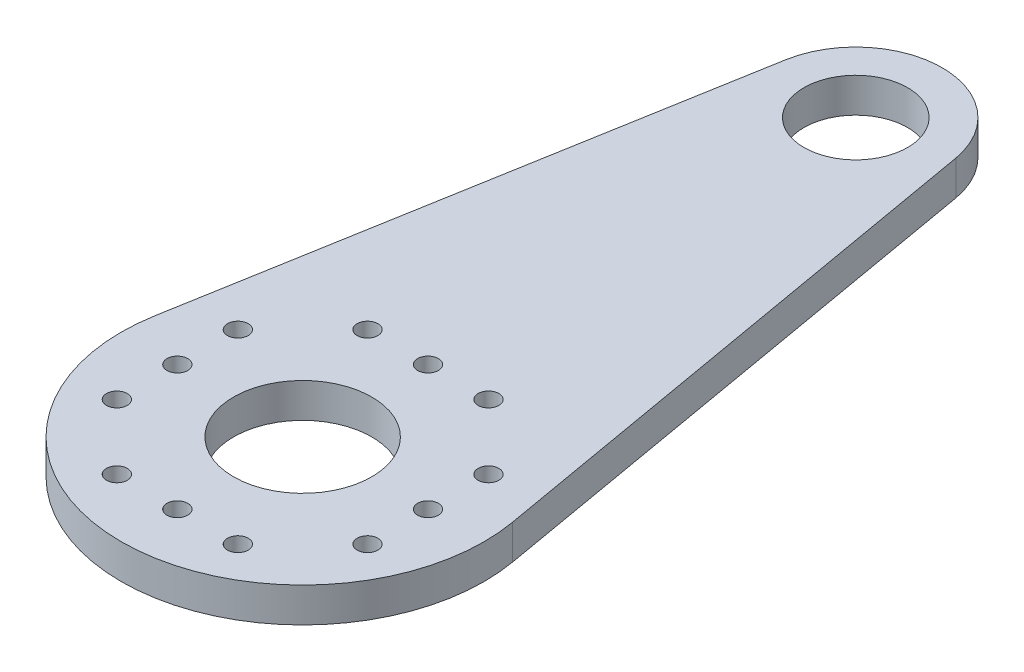
ISO-10303-21;
HEADER;
FILE_DESCRIPTION(('STEP AP214'),'2;1');
FILE_NAME('part.step','',(''),(''),'','','');
FILE_SCHEMA(('AUTOMOTIVE_DESIGN { 1 0 10303 214 1 1 1 1 }'));
ENDSEC;
DATA;
#1=APPLICATION_CONTEXT('core data for automotive mechanical design processes');
#2=APPLICATION_PROTOCOL_DEFINITION('international standard','automotive_design',2000,#1);
#3=PRODUCT_CONTEXT('',#1,'mechanical');
#4=PRODUCT('Part','Part','',(#3));
#5=PRODUCT_RELATED_PRODUCT_CATEGORY('part','',(#4));
#6=PRODUCT_DEFINITION_FORMATION('','',#4);
#7=PRODUCT_DEFINITION_CONTEXT('part definition',#1,'design');
#8=PRODUCT_DEFINITION('design','',#6,#7);
#9=PRODUCT_DEFINITION_SHAPE('','',#8);
#10=(LENGTH_UNIT() NAMED_UNIT(*) SI_UNIT(.MILLI.,.METRE.));
#11=(NAMED_UNIT(*) PLANE_ANGLE_UNIT() SI_UNIT($,.RADIAN.));
#12=(NAMED_UNIT(*) SI_UNIT($,.STERADIAN.) SOLID_ANGLE_UNIT());
#13=UNCERTAINTY_MEASURE_WITH_UNIT(LENGTH_MEASURE(1.E-05),#10,'distance_accuracy_value','');
#14=(GEOMETRIC_REPRESENTATION_CONTEXT(3) GLOBAL_UNCERTAINTY_ASSIGNED_CONTEXT((#13)) GLOBAL_UNIT_ASSIGNED_CONTEXT((#10,
#11,#12)) REPRESENTATION_CONTEXT('',''));
#15=CARTESIAN_POINT('',(0.,0.,0.));
#16=DIRECTION('',(0.,0.,1.));
#17=DIRECTION('',(1.,0.,0.));
#18=AXIS2_PLACEMENT_3D('',#15,#16,#17);
#19=CARTESIAN_POINT('',(0.,2.,-32.));
#20=DIRECTION('',(0.,1.,0.));
#21=DIRECTION('',(0.,0.,1.));
#22=AXIS2_PLACEMENT_3D('',#19,#20,#21);
#23=PLANE('',#22);
#24=CARTESIAN_POINT('',(-7.24999999999999,2.,3.50000000000003));
#25=DIRECTION('',(0.,1.,0.));
#26=DIRECTION('',(1.,0.,0.));
#27=AXIS2_PLACEMENT_3D('',#24,#25,#26);
#28=CIRCLE('',#27,0.6);
#29=CARTESIAN_POINT('',(-6.64999999999999,2.,3.50000000000002));
#30=VERTEX_POINT('',#29);
#31=EDGE_CURVE('E171',#30,#30,#28,.T.);
#32=ORIENTED_EDGE('',*,*,#31,.F.);
#33=EDGE_LOOP('',(#32));
#34=FACE_BOUND('',#33,.T.);
#35=CARTESIAN_POINT('',(3.5,2.,7.25));
#36=DIRECTION('',(0.,1.,0.));
#37=DIRECTION('',(0.,0.,-1.));
#38=AXIS2_PLACEMENT_3D('',#35,#36,#37);
#39=CIRCLE('',#38,0.6);
#40=CARTESIAN_POINT('',(3.5,2.,6.65));
#41=VERTEX_POINT('',#40);
#42=EDGE_CURVE('E189',#41,#41,#39,.T.);
#43=ORIENTED_EDGE('',*,*,#42,.F.);
#44=EDGE_LOOP('',(#43));
#45=FACE_BOUND('',#44,.T.);
#46=CARTESIAN_POINT('',(7.24999999999996,2.,-3.50000000000008));
#47=DIRECTION('',(0.,1.,0.));
#48=DIRECTION('',(-1.,0.,0.));
#49=AXIS2_PLACEMENT_3D('',#46,#47,#48);
#50=CIRCLE('',#49,0.6);
#51=CARTESIAN_POINT('',(6.64999999999996,2.,-3.50000000000007));
#52=VERTEX_POINT('',#51);
#53=EDGE_CURVE('E182',#52,#52,#50,.T.);
#54=ORIENTED_EDGE('',*,*,#53,.F.);
#55=EDGE_LOOP('',(#54));
#56=FACE_BOUND('',#55,.T.);
#57=CARTESIAN_POINT('',(-7.25,2.,0.));
#58=DIRECTION('',(0.,1.,0.));
#59=DIRECTION('',(1.,0.,0.));
#60=AXIS2_PLACEMENT_3D('',#57,#58,#59);
#61=CIRCLE('',#60,0.6);
#62=CARTESIAN_POINT('',(-6.65,2.,0.));
#63=VERTEX_POINT('',#62);
#64=EDGE_CURVE('E153',#63,#63,#61,.T.);
#65=ORIENTED_EDGE('',*,*,#64,.F.);
#66=EDGE_LOOP('',(#65));
#67=FACE_BOUND('',#66,.T.);
#68=CARTESIAN_POINT('',(0.,2.,7.25));
#69=DIRECTION('',(0.,1.,0.));
#70=DIRECTION('',(0.,0.,-1.));
#71=AXIS2_PLACEMENT_3D('',#68,#69,#70);
#72=CIRCLE('',#71,0.6);
#73=CARTESIAN_POINT('',(0.,2.,6.65));
#74=VERTEX_POINT('',#73);
#75=EDGE_CURVE('E172',#74,#74,#72,.T.);
#76=ORIENTED_EDGE('',*,*,#75,.F.);
#77=EDGE_LOOP('',(#76));
#78=FACE_BOUND('',#77,.T.);
#79=CARTESIAN_POINT('',(7.25,2.,0.));
#80=DIRECTION('',(0.,1.,0.));
#81=DIRECTION('',(-1.,0.,0.));
#82=AXIS2_PLACEMENT_3D('',#79,#80,#81);
#83=CIRCLE('',#82,0.6);
#84=CARTESIAN_POINT('',(6.65,2.,0.));
#85=VERTEX_POINT('',#84);
#86=EDGE_CURVE('E164',#85,#85,#83,.T.);
#87=ORIENTED_EDGE('',*,*,#86,.F.);
#88=EDGE_LOOP('',(#87));
#89=FACE_BOUND('',#88,.T.);
#90=CARTESIAN_POINT('',(-7.25000000000001,2.,-3.49999999999998));
#91=DIRECTION('',(0.,1.,0.));
#92=DIRECTION('',(1.,0.,0.));
#93=AXIS2_PLACEMENT_3D('',#90,#91,#92);
#94=CIRCLE('',#93,0.6);
#95=CARTESIAN_POINT('',(-6.65000000000001,2.,-3.49999999999998));
#96=VERTEX_POINT('',#95);
#97=EDGE_CURVE('E141',#96,#96,#94,.T.);
#98=ORIENTED_EDGE('',*,*,#97,.F.);
#99=EDGE_LOOP('',(#98));
#100=FACE_BOUND('',#99,.T.);
#101=CARTESIAN_POINT('',(-3.5,2.,7.25));
#102=DIRECTION('',(0.,1.,0.));
#103=DIRECTION('',(0.,0.,-1.));
#104=AXIS2_PLACEMENT_3D('',#101,#102,#103);
#105=CIRCLE('',#104,0.6);
#106=CARTESIAN_POINT('',(-3.5,2.,6.65));
#107=VERTEX_POINT('',#106);
#108=EDGE_CURVE('E154',#107,#107,#105,.T.);
#109=ORIENTED_EDGE('',*,*,#108,.F.);
#110=EDGE_LOOP('',(#109));
#111=FACE_BOUND('',#110,.T.);
#112=CARTESIAN_POINT('',(7.25000000000004,2.,3.49999999999992));
#113=DIRECTION('',(0.,1.,0.));
#114=DIRECTION('',(-1.,0.,0.));
#115=AXIS2_PLACEMENT_3D('',#112,#113,#114);
#116=CIRCLE('',#115,0.6);
#117=CARTESIAN_POINT('',(6.65000000000004,2.,3.49999999999993));
#118=VERTEX_POINT('',#117);
#119=EDGE_CURVE('E146',#118,#118,#116,.T.);
#120=ORIENTED_EDGE('',*,*,#119,.F.);
#121=EDGE_LOOP('',(#120));
#122=FACE_BOUND('',#121,.T.);
#123=CARTESIAN_POINT('',(3.5,2.,-7.25));
#124=DIRECTION('',(0.,1.,0.));
#125=DIRECTION('',(0.,0.,1.));
#126=AXIS2_PLACEMENT_3D('',#123,#124,#125);
#127=CIRCLE('',#126,0.6);
#128=CARTESIAN_POINT('',(3.5,2.,-6.65));
#129=VERTEX_POINT('',#128);
#130=EDGE_CURVE('E138',#129,#129,#127,.T.);
#131=ORIENTED_EDGE('',*,*,#130,.F.);
#132=EDGE_LOOP('',(#131));
#133=FACE_BOUND('',#132,.T.);
#134=CARTESIAN_POINT('',(-3.5,2.,-7.25));
#135=DIRECTION('',(0.,1.,0.));
#136=DIRECTION('',(0.,0.,1.));
#137=AXIS2_PLACEMENT_3D('',#134,#135,#136);
#138=CIRCLE('',#137,0.6);
#139=CARTESIAN_POINT('',(-3.5,2.,-6.65));
#140=VERTEX_POINT('',#139);
#141=EDGE_CURVE('E137',#140,#140,#138,.T.);
#142=ORIENTED_EDGE('',*,*,#141,.F.);
#143=EDGE_LOOP('',(#142));
#144=FACE_BOUND('',#143,.T.);
#145=CARTESIAN_POINT('',(0.,2.,-7.25));
#146=DIRECTION('',(0.,1.,0.));
#147=DIRECTION('',(0.,0.,1.));
#148=AXIS2_PLACEMENT_3D('',#145,#146,#147);
#149=CIRCLE('',#148,0.6);
#150=CARTESIAN_POINT('',(0.,2.,-6.65));
#151=VERTEX_POINT('',#150);
#152=EDGE_CURVE('E130',#151,#151,#149,.T.);
#153=ORIENTED_EDGE('',*,*,#152,.F.);
#154=EDGE_LOOP('',(#153));
#155=FACE_BOUND('',#154,.T.);
#156=CARTESIAN_POINT('',(0.,2.,0.));
#157=DIRECTION('',(0.,1.,0.));
#158=DIRECTION('',(0.,0.,1.));
#159=AXIS2_PLACEMENT_3D('',#156,#157,#158);
#160=CIRCLE('',#159,4.);
#161=CARTESIAN_POINT('',(0.,2.,4.));
#162=VERTEX_POINT('',#161);
#163=EDGE_CURVE('E104',#162,#162,#160,.T.);
#164=ORIENTED_EDGE('',*,*,#163,.F.);
#165=EDGE_LOOP('',(#164));
#166=FACE_BOUND('',#165,.T.);
#167=CARTESIAN_POINT('',(0.,2.,-32.));
#168=DIRECTION('',(0.,1.,0.));
#169=DIRECTION('',(0.,0.,1.));
#170=AXIS2_PLACEMENT_3D('',#167,#168,#169);
#171=CIRCLE('',#170,5.);
#172=CARTESIAN_POINT('',(4.92559383317129,2.,-32.859375));
#173=VERTEX_POINT('',#172);
#174=CARTESIAN_POINT('',(-4.92559383317129,2.,-32.859375));
#175=VERTEX_POINT('',#174);
#176=EDGE_CURVE('E89',#173,#175,#171,.T.);
#177=ORIENTED_EDGE('',*,*,#176,.T.);
#178=DIRECTION('',(-0.171875,0.,0.985118766634257));
#179=VECTOR('',#178,1.);
#180=CARTESIAN_POINT('',(-4.92559383317129,2.,-32.859375));
#181=LINE('',#180,#179);
#182=CARTESIAN_POINT('',(-10.3437470496597,2.,-1.80468750000001));
#183=VERTEX_POINT('',#182);
#184=EDGE_CURVE('E84',#175,#183,#181,.T.);
#185=ORIENTED_EDGE('',*,*,#184,.T.);
#186=CARTESIAN_POINT('',(0.,2.,0.));
#187=DIRECTION('',(0.,1.,0.));
#188=DIRECTION('',(0.,0.,1.));
#189=AXIS2_PLACEMENT_3D('',#186,#187,#188);
#190=CIRCLE('',#189,10.5);
#191=CARTESIAN_POINT('',(10.3437470496597,2.,-1.8046875));
#192=VERTEX_POINT('',#191);
#193=EDGE_CURVE('E87',#183,#192,#190,.T.);
#194=ORIENTED_EDGE('',*,*,#193,.T.);
#195=DIRECTION('',(-0.171875,0.,-0.985118766634257));
#196=VECTOR('',#195,1.);
#197=CARTESIAN_POINT('',(4.92559383317129,2.,-32.859375));
#198=LINE('',#197,#196);
#199=EDGE_CURVE('E54',#192,#173,#198,.T.);
#200=ORIENTED_EDGE('',*,*,#199,.T.);
#201=EDGE_LOOP('',(#177,#185,#194,#200));
#202=FACE_BOUND('',#201,.T.);
#203=CARTESIAN_POINT('',(0.,2.,-32.));
#204=DIRECTION('',(0.,1.,0.));
#205=DIRECTION('',(0.,0.,1.));
#206=AXIS2_PLACEMENT_3D('',#203,#204,#205);
#207=CIRCLE('',#206,3.);
#208=CARTESIAN_POINT('',(0.,2.,-29.));
#209=VERTEX_POINT('',#208);
#210=EDGE_CURVE('E119',#209,#209,#207,.T.);
#211=ORIENTED_EDGE('',*,*,#210,.F.);
#212=EDGE_LOOP('',(#211));
#213=FACE_BOUND('',#212,.T.);
#214=ADVANCED_FACE('F37',(#34,#45,#56,#67,#78,#89,#100,#111,#122,#133,#144,#155,#166,#202,#213),
#23,.T.);
#215=CARTESIAN_POINT('',(0.,0.,-32.));
#216=DIRECTION('',(0.,1.,0.));
#217=DIRECTION('',(0.,0.,1.));
#218=AXIS2_PLACEMENT_3D('',#215,#216,#217);
#219=PLANE('',#218);
#220=CARTESIAN_POINT('',(-7.24999999999999,0.,3.50000000000003));
#221=DIRECTION('',(0.,1.,0.));
#222=DIRECTION('',(1.,0.,0.));
#223=AXIS2_PLACEMENT_3D('',#220,#221,#222);
#224=CIRCLE('',#223,0.6);
#225=CARTESIAN_POINT('',(-6.64999999999999,0.,3.50000000000002));
#226=VERTEX_POINT('',#225);
#227=EDGE_CURVE('E192',#226,#226,#224,.F.);
#228=ORIENTED_EDGE('',*,*,#227,.F.);
#229=EDGE_LOOP('',(#228));
#230=FACE_BOUND('',#229,.T.);
#231=CARTESIAN_POINT('',(3.5,0.,7.25));
#232=DIRECTION('',(0.,1.,0.));
#233=DIRECTION('',(0.,0.,-1.));
#234=AXIS2_PLACEMENT_3D('',#231,#232,#233);
#235=CIRCLE('',#234,0.6);
#236=CARTESIAN_POINT('',(3.5,0.,6.65));
#237=VERTEX_POINT('',#236);
#238=EDGE_CURVE('E185',#237,#237,#235,.F.);
#239=ORIENTED_EDGE('',*,*,#238,.F.);
#240=EDGE_LOOP('',(#239));
#241=FACE_BOUND('',#240,.T.);
#242=CARTESIAN_POINT('',(7.24999999999996,0.,-3.50000000000008));
#243=DIRECTION('',(0.,1.,0.));
#244=DIRECTION('',(-1.,0.,0.));
#245=AXIS2_PLACEMENT_3D('',#242,#243,#244);
#246=CIRCLE('',#245,0.6);
#247=CARTESIAN_POINT('',(6.64999999999996,0.,-3.50000000000007));
#248=VERTEX_POINT('',#247);
#249=EDGE_CURVE('E186',#248,#248,#246,.F.);
#250=ORIENTED_EDGE('',*,*,#249,.F.);
#251=EDGE_LOOP('',(#250));
#252=FACE_BOUND('',#251,.T.);
#253=CARTESIAN_POINT('',(-7.25,0.,0.));
#254=DIRECTION('',(0.,1.,0.));
#255=DIRECTION('',(1.,0.,0.));
#256=AXIS2_PLACEMENT_3D('',#253,#254,#255);
#257=CIRCLE('',#256,0.6);
#258=CARTESIAN_POINT('',(-6.65,0.,0.));
#259=VERTEX_POINT('',#258);
#260=EDGE_CURVE('E175',#259,#259,#257,.F.);
#261=ORIENTED_EDGE('',*,*,#260,.F.);
#262=EDGE_LOOP('',(#261));
#263=FACE_BOUND('',#262,.T.);
#264=CARTESIAN_POINT('',(0.,0.,7.25));
#265=DIRECTION('',(0.,1.,0.));
#266=DIRECTION('',(0.,0.,-1.));
#267=AXIS2_PLACEMENT_3D('',#264,#265,#266);
#268=CIRCLE('',#267,0.6);
#269=CARTESIAN_POINT('',(0.,0.,6.65));
#270=VERTEX_POINT('',#269);
#271=EDGE_CURVE('E167',#270,#270,#268,.F.);
#272=ORIENTED_EDGE('',*,*,#271,.F.);
#273=EDGE_LOOP('',(#272));
#274=FACE_BOUND('',#273,.T.);
#275=CARTESIAN_POINT('',(7.25,0.,0.));
#276=DIRECTION('',(0.,1.,0.));
#277=DIRECTION('',(-1.,0.,0.));
#278=AXIS2_PLACEMENT_3D('',#275,#276,#277);
#279=CIRCLE('',#278,0.6);
#280=CARTESIAN_POINT('',(6.65,0.,0.));
#281=VERTEX_POINT('',#280);
#282=EDGE_CURVE('E168',#281,#281,#279,.F.);
#283=ORIENTED_EDGE('',*,*,#282,.F.);
#284=EDGE_LOOP('',(#283));
#285=FACE_BOUND('',#284,.T.);
#286=CARTESIAN_POINT('',(-7.25000000000001,0.,-3.49999999999998));
#287=DIRECTION('',(0.,1.,0.));
#288=DIRECTION('',(1.,0.,0.));
#289=AXIS2_PLACEMENT_3D('',#286,#287,#288);
#290=CIRCLE('',#289,0.6);
#291=CARTESIAN_POINT('',(-6.65000000000001,0.,-3.49999999999998));
#292=VERTEX_POINT('',#291);
#293=EDGE_CURVE('E157',#292,#292,#290,.F.);
#294=ORIENTED_EDGE('',*,*,#293,.F.);
#295=EDGE_LOOP('',(#294));
#296=FACE_BOUND('',#295,.T.);
#297=CARTESIAN_POINT('',(-3.5,0.,7.25));
#298=DIRECTION('',(0.,1.,0.));
#299=DIRECTION('',(0.,0.,-1.));
#300=AXIS2_PLACEMENT_3D('',#297,#298,#299);
#301=CIRCLE('',#300,0.6);
#302=CARTESIAN_POINT('',(-3.5,0.,6.65));
#303=VERTEX_POINT('',#302);
#304=EDGE_CURVE('E149',#303,#303,#301,.F.);
#305=ORIENTED_EDGE('',*,*,#304,.F.);
#306=EDGE_LOOP('',(#305));
#307=FACE_BOUND('',#306,.T.);
#308=CARTESIAN_POINT('',(7.25000000000004,0.,3.49999999999992));
#309=DIRECTION('',(0.,1.,0.));
#310=DIRECTION('',(-1.,0.,0.));
#311=AXIS2_PLACEMENT_3D('',#308,#309,#310);
#312=CIRCLE('',#311,0.6);
#313=CARTESIAN_POINT('',(6.65000000000004,0.,3.49999999999993));
#314=VERTEX_POINT('',#313);
#315=EDGE_CURVE('E150',#314,#314,#312,.F.);
#316=ORIENTED_EDGE('',*,*,#315,.F.);
#317=EDGE_LOOP('',(#316));
#318=FACE_BOUND('',#317,.T.);
#319=CARTESIAN_POINT('',(3.5,0.,-7.25));
#320=DIRECTION('',(0.,1.,0.));
#321=DIRECTION('',(0.,0.,1.));
#322=AXIS2_PLACEMENT_3D('',#319,#320,#321);
#323=CIRCLE('',#322,0.6);
#324=CARTESIAN_POINT('',(3.5,0.,-6.65));
#325=VERTEX_POINT('',#324);
#326=EDGE_CURVE('E134',#325,#325,#323,.F.);
#327=ORIENTED_EDGE('',*,*,#326,.F.);
#328=EDGE_LOOP('',(#327));
#329=FACE_BOUND('',#328,.T.);
#330=CARTESIAN_POINT('',(-3.5,0.,-7.25));
#331=DIRECTION('',(0.,1.,0.));
#332=DIRECTION('',(0.,0.,1.));
#333=AXIS2_PLACEMENT_3D('',#330,#331,#332);
#334=CIRCLE('',#333,0.6);
#335=CARTESIAN_POINT('',(-3.5,0.,-6.65));
#336=VERTEX_POINT('',#335);
#337=EDGE_CURVE('E133',#336,#336,#334,.F.);
#338=ORIENTED_EDGE('',*,*,#337,.F.);
#339=EDGE_LOOP('',(#338));
#340=FACE_BOUND('',#339,.T.);
#341=CARTESIAN_POINT('',(0.,0.,-7.25));
#342=DIRECTION('',(0.,1.,0.));
#343=DIRECTION('',(0.,0.,1.));
#344=AXIS2_PLACEMENT_3D('',#341,#342,#343);
#345=CIRCLE('',#344,0.6);
#346=CARTESIAN_POINT('',(0.,0.,-6.65));
#347=VERTEX_POINT('',#346);
#348=EDGE_CURVE('E125',#347,#347,#345,.F.);
#349=ORIENTED_EDGE('',*,*,#348,.F.);
#350=EDGE_LOOP('',(#349));
#351=FACE_BOUND('',#350,.T.);
#352=CARTESIAN_POINT('',(0.,0.,-32.));
#353=DIRECTION('',(0.,1.,0.));
#354=DIRECTION('',(0.,0.,1.));
#355=AXIS2_PLACEMENT_3D('',#352,#353,#354);
#356=CIRCLE('',#355,5.);
#357=CARTESIAN_POINT('',(4.92559383317129,0.,-32.859375));
#358=VERTEX_POINT('',#357);
#359=CARTESIAN_POINT('',(-4.92559383317129,0.,-32.859375));
#360=VERTEX_POINT('',#359);
#361=EDGE_CURVE('E101',#358,#360,#356,.T.);
#362=ORIENTED_EDGE('',*,*,#361,.F.);
#363=DIRECTION('',(-0.171875,0.,-0.985118766634257));
#364=VECTOR('',#363,1.);
#365=CARTESIAN_POINT('',(4.92559383317129,0.,-32.859375));
#366=LINE('',#365,#364);
#367=CARTESIAN_POINT('',(10.3437470496597,0.,-1.8046875));
#368=VERTEX_POINT('',#367);
#369=EDGE_CURVE('E77',#368,#358,#366,.T.);
#370=ORIENTED_EDGE('',*,*,#369,.F.);
#371=CARTESIAN_POINT('',(0.,0.,0.));
#372=DIRECTION('',(0.,1.,0.));
#373=DIRECTION('',(0.,0.,1.));
#374=AXIS2_PLACEMENT_3D('',#371,#372,#373);
#375=CIRCLE('',#374,10.5);
#376=CARTESIAN_POINT('',(-10.3437470496597,0.,-1.80468750000001));
#377=VERTEX_POINT('',#376);
#378=EDGE_CURVE('E71',#377,#368,#375,.T.);
#379=ORIENTED_EDGE('',*,*,#378,.F.);
#380=DIRECTION('',(-0.171875,0.,0.985118766634257));
#381=VECTOR('',#380,1.);
#382=CARTESIAN_POINT('',(-4.92559383317129,0.,-32.859375));
#383=LINE('',#382,#381);
#384=EDGE_CURVE('E93',#360,#377,#383,.T.);
#385=ORIENTED_EDGE('',*,*,#384,.F.);
#386=EDGE_LOOP('',(#362,#370,#379,#385));
#387=FACE_BOUND('',#386,.T.);
#388=CARTESIAN_POINT('',(0.,0.,0.));
#389=DIRECTION('',(0.,1.,0.));
#390=DIRECTION('',(0.,0.,1.));
#391=AXIS2_PLACEMENT_3D('',#388,#389,#390);
#392=CIRCLE('',#391,4.);
#393=CARTESIAN_POINT('',(0.,0.,4.));
#394=VERTEX_POINT('',#393);
#395=EDGE_CURVE('E116',#394,#394,#392,.T.);
#396=ORIENTED_EDGE('',*,*,#395,.T.);
#397=EDGE_LOOP('',(#396));
#398=FACE_BOUND('',#397,.T.);
#399=CARTESIAN_POINT('',(0.,0.,-32.));
#400=DIRECTION('',(0.,1.,0.));
#401=DIRECTION('',(0.,0.,1.));
#402=AXIS2_PLACEMENT_3D('',#399,#400,#401);
#403=CIRCLE('',#402,3.);
#404=CARTESIAN_POINT('',(0.,0.,-29.));
#405=VERTEX_POINT('',#404);
#406=EDGE_CURVE('E122',#405,#405,#403,.T.);
#407=ORIENTED_EDGE('',*,*,#406,.T.);
#408=EDGE_LOOP('',(#407));
#409=FACE_BOUND('',#408,.T.);
#410=ADVANCED_FACE('F112',(#230,#241,#252,#263,#274,#285,#296,#307,#318,#329,#340,#351,#387,
#398,#409),#219,.F.);
#411=CARTESIAN_POINT('',(0.,2.,-32.));
#412=DIRECTION('',(0.,-1.,0.));
#413=DIRECTION('',(0.,0.,-1.));
#414=AXIS2_PLACEMENT_3D('',#411,#412,#413);
#415=CYLINDRICAL_SURFACE('',#414,5.);
#416=ORIENTED_EDGE('',*,*,#361,.T.);
#417=DIRECTION('',(0.,-1.,0.));
#418=VECTOR('',#417,1.);
#419=CARTESIAN_POINT('',(-4.92559383317129,2.,-32.859375));
#420=LINE('',#419,#418);
#421=EDGE_CURVE('E11',#175,#360,#420,.T.);
#422=ORIENTED_EDGE('',*,*,#421,.F.);
#423=ORIENTED_EDGE('',*,*,#176,.F.);
#424=DIRECTION('',(0.,-1.,0.));
#425=VECTOR('',#424,1.);
#426=CARTESIAN_POINT('',(4.92559383317129,2.,-32.859375));
#427=LINE('',#426,#425);
#428=EDGE_CURVE('E97',#173,#358,#427,.T.);
#429=ORIENTED_EDGE('',*,*,#428,.T.);
#430=EDGE_LOOP('',(#416,#422,#423,#429));
#431=FACE_BOUND('',#430,.T.);
#432=ADVANCED_FACE('F39',(#431),#415,.T.);
#433=CARTESIAN_POINT('',(-4.92559383317129,2.,-32.859375));
#434=DIRECTION('',(0.985118766634257,0.,0.171875));
#435=DIRECTION('',(0.171875,0.,-0.985118766634257));
#436=AXIS2_PLACEMENT_3D('',#433,#434,#435);
#437=PLANE('',#436);
#438=ORIENTED_EDGE('',*,*,#384,.T.);
#439=DIRECTION('',(0.,-1.,0.));
#440=VECTOR('',#439,1.);
#441=CARTESIAN_POINT('',(-10.3437470496597,2.,-1.80468750000001));
#442=LINE('',#441,#440);
#443=EDGE_CURVE('E46',#183,#377,#442,.T.);
#444=ORIENTED_EDGE('',*,*,#443,.F.);
#445=ORIENTED_EDGE('',*,*,#184,.F.);
#446=ORIENTED_EDGE('',*,*,#421,.T.);
#447=EDGE_LOOP('',(#438,#444,#445,#446));
#448=FACE_BOUND('',#447,.T.);
#449=ADVANCED_FACE('F92',(#448),#437,.F.);
#450=CARTESIAN_POINT('',(0.,2.,0.));
#451=DIRECTION('',(0.,-1.,0.));
#452=DIRECTION('',(0.,0.,-1.));
#453=AXIS2_PLACEMENT_3D('',#450,#451,#452);
#454=CYLINDRICAL_SURFACE('',#453,10.5);
#455=ORIENTED_EDGE('',*,*,#378,.T.);
#456=DIRECTION('',(0.,-1.,0.));
#457=VECTOR('',#456,1.);
#458=CARTESIAN_POINT('',(10.3437470496597,2.,-1.8046875));
#459=LINE('',#458,#457);
#460=EDGE_CURVE('E94',#192,#368,#459,.T.);
#461=ORIENTED_EDGE('',*,*,#460,.F.);
#462=ORIENTED_EDGE('',*,*,#193,.F.);
#463=ORIENTED_EDGE('',*,*,#443,.T.);
#464=EDGE_LOOP('',(#455,#461,#462,#463));
#465=FACE_BOUND('',#464,.T.);
#466=ADVANCED_FACE('F95',(#465),#454,.T.);
#467=CARTESIAN_POINT('',(4.92559383317129,2.,-32.859375));
#468=DIRECTION('',(-0.985118766634257,0.,0.171875));
#469=DIRECTION('',(0.171875,0.,0.985118766634257));
#470=AXIS2_PLACEMENT_3D('',#467,#468,#469);
#471=PLANE('',#470);
#472=ORIENTED_EDGE('',*,*,#369,.T.);
#473=ORIENTED_EDGE('',*,*,#428,.F.);
#474=ORIENTED_EDGE('',*,*,#199,.F.);
#475=ORIENTED_EDGE('',*,*,#460,.T.);
#476=EDGE_LOOP('',(#472,#473,#474,#475));
#477=FACE_BOUND('',#476,.T.);
#478=ADVANCED_FACE('F109',(#477),#471,.F.);
#479=CARTESIAN_POINT('',(0.,2.,0.));
#480=DIRECTION('',(0.,-1.,0.));
#481=DIRECTION('',(0.,0.,-1.));
#482=AXIS2_PLACEMENT_3D('',#479,#480,#481);
#483=CYLINDRICAL_SURFACE('',#482,4.);
#484=ORIENTED_EDGE('',*,*,#163,.T.);
#485=EDGE_LOOP('',(#484));
#486=FACE_BOUND('',#485,.T.);
#487=ORIENTED_EDGE('',*,*,#395,.F.);
#488=EDGE_LOOP('',(#487));
#489=FACE_BOUND('',#488,.T.);
#490=ADVANCED_FACE('F242',(#486,#489),#483,.F.);
#491=CARTESIAN_POINT('',(0.,2.,-32.));
#492=DIRECTION('',(0.,-1.,0.));
#493=DIRECTION('',(0.,0.,-1.));
#494=AXIS2_PLACEMENT_3D('',#491,#492,#493);
#495=CYLINDRICAL_SURFACE('',#494,3.);
#496=ORIENTED_EDGE('',*,*,#210,.T.);
#497=EDGE_LOOP('',(#496));
#498=FACE_BOUND('',#497,.T.);
#499=ORIENTED_EDGE('',*,*,#406,.F.);
#500=EDGE_LOOP('',(#499));
#501=FACE_BOUND('',#500,.T.);
#502=ADVANCED_FACE('F232',(#498,#501),#495,.F.);
#503=CARTESIAN_POINT('',(0.,-1.69705627484771,-7.25));
#504=DIRECTION('',(0.,1.,0.));
#505=DIRECTION('',(0.,0.,1.));
#506=AXIS2_PLACEMENT_3D('',#503,#504,#505);
#507=CYLINDRICAL_SURFACE('',#506,0.6);
#508=ORIENTED_EDGE('',*,*,#348,.T.);
#509=EDGE_LOOP('',(#508));
#510=FACE_BOUND('',#509,.T.);
#511=ORIENTED_EDGE('',*,*,#152,.T.);
#512=EDGE_LOOP('',(#511));
#513=FACE_BOUND('',#512,.T.);
#514=ADVANCED_FACE('F228',(#510,#513),#507,.F.);
#515=CARTESIAN_POINT('',(-3.5,-1.69705627484771,-7.25));
#516=DIRECTION('',(0.,1.,0.));
#517=DIRECTION('',(0.,0.,1.));
#518=AXIS2_PLACEMENT_3D('',#515,#516,#517);
#519=CYLINDRICAL_SURFACE('',#518,0.6);
#520=ORIENTED_EDGE('',*,*,#337,.T.);
#521=EDGE_LOOP('',(#520));
#522=FACE_BOUND('',#521,.T.);
#523=ORIENTED_EDGE('',*,*,#141,.T.);
#524=EDGE_LOOP('',(#523));
#525=FACE_BOUND('',#524,.T.);
#526=ADVANCED_FACE('F231',(#522,#525),#519,.F.);
#527=CARTESIAN_POINT('',(3.5,-1.69705627484771,-7.25));
#528=DIRECTION('',(0.,1.,0.));
#529=DIRECTION('',(0.,0.,1.));
#530=AXIS2_PLACEMENT_3D('',#527,#528,#529);
#531=CYLINDRICAL_SURFACE('',#530,0.6);
#532=ORIENTED_EDGE('',*,*,#326,.T.);
#533=EDGE_LOOP('',(#532));
#534=FACE_BOUND('',#533,.T.);
#535=ORIENTED_EDGE('',*,*,#130,.T.);
#536=EDGE_LOOP('',(#535));
#537=FACE_BOUND('',#536,.T.);
#538=ADVANCED_FACE('F280',(#534,#537),#531,.F.);
#539=CARTESIAN_POINT('',(7.25000000000004,-1.69705627484771,3.49999999999992));
#540=DIRECTION('',(0.,1.,0.));
#541=DIRECTION('',(-1.,0.,0.));
#542=AXIS2_PLACEMENT_3D('',#539,#540,#541);
#543=CYLINDRICAL_SURFACE('',#542,0.6);
#544=ORIENTED_EDGE('',*,*,#315,.T.);
#545=EDGE_LOOP('',(#544));
#546=FACE_BOUND('',#545,.T.);
#547=ORIENTED_EDGE('',*,*,#119,.T.);
#548=EDGE_LOOP('',(#547));
#549=FACE_BOUND('',#548,.T.);
#550=ADVANCED_FACE('F285',(#546,#549),#543,.F.);
#551=CARTESIAN_POINT('',(-3.5,-1.69705627484771,7.25));
#552=DIRECTION('',(0.,1.,0.));
#553=DIRECTION('',(0.,0.,-1.));
#554=AXIS2_PLACEMENT_3D('',#551,#552,#553);
#555=CYLINDRICAL_SURFACE('',#554,0.6);
#556=ORIENTED_EDGE('',*,*,#304,.T.);
#557=EDGE_LOOP('',(#556));
#558=FACE_BOUND('',#557,.T.);
#559=ORIENTED_EDGE('',*,*,#108,.T.);
#560=EDGE_LOOP('',(#559));
#561=FACE_BOUND('',#560,.T.);
#562=ADVANCED_FACE('F339',(#558,#561),#555,.F.);
#563=CARTESIAN_POINT('',(-7.25000000000001,-1.69705627484771,-3.49999999999998));
#564=DIRECTION('',(0.,1.,0.));
#565=DIRECTION('',(1.,0.,0.));
#566=AXIS2_PLACEMENT_3D('',#563,#564,#565);
#567=CYLINDRICAL_SURFACE('',#566,0.6);
#568=ORIENTED_EDGE('',*,*,#293,.T.);
#569=EDGE_LOOP('',(#568));
#570=FACE_BOUND('',#569,.T.);
#571=ORIENTED_EDGE('',*,*,#97,.T.);
#572=EDGE_LOOP('',(#571));
#573=FACE_BOUND('',#572,.T.);
#574=ADVANCED_FACE('F343',(#570,#573),#567,.F.);
#575=CARTESIAN_POINT('',(7.25,-1.69705627484771,0.));
#576=DIRECTION('',(0.,1.,0.));
#577=DIRECTION('',(-1.,0.,0.));
#578=AXIS2_PLACEMENT_3D('',#575,#576,#577);
#579=CYLINDRICAL_SURFACE('',#578,0.6);
#580=ORIENTED_EDGE('',*,*,#282,.T.);
#581=EDGE_LOOP('',(#580));
#582=FACE_BOUND('',#581,.T.);
#583=ORIENTED_EDGE('',*,*,#86,.T.);
#584=EDGE_LOOP('',(#583));
#585=FACE_BOUND('',#584,.T.);
#586=ADVANCED_FACE('F347',(#582,#585),#579,.F.);
#587=CARTESIAN_POINT('',(0.,-1.69705627484771,7.25));
#588=DIRECTION('',(0.,1.,0.));
#589=DIRECTION('',(0.,0.,-1.));
#590=AXIS2_PLACEMENT_3D('',#587,#588,#589);
#591=CYLINDRICAL_SURFACE('',#590,0.6);
#592=ORIENTED_EDGE('',*,*,#271,.T.);
#593=EDGE_LOOP('',(#592));
#594=FACE_BOUND('',#593,.T.);
#595=ORIENTED_EDGE('',*,*,#75,.T.);
#596=EDGE_LOOP('',(#595));
#597=FACE_BOUND('',#596,.T.);
#598=ADVANCED_FACE('F351',(#594,#597),#591,.F.);
#599=CARTESIAN_POINT('',(-7.25,-1.69705627484771,0.));
#600=DIRECTION('',(0.,1.,0.));
#601=DIRECTION('',(1.,0.,0.));
#602=AXIS2_PLACEMENT_3D('',#599,#600,#601);
#603=CYLINDRICAL_SURFACE('',#602,0.6);
#604=ORIENTED_EDGE('',*,*,#260,.T.);
#605=EDGE_LOOP('',(#604));
#606=FACE_BOUND('',#605,.T.);
#607=ORIENTED_EDGE('',*,*,#64,.T.);
#608=EDGE_LOOP('',(#607));
#609=FACE_BOUND('',#608,.T.);
#610=ADVANCED_FACE('F355',(#606,#609),#603,.F.);
#611=CARTESIAN_POINT('',(7.24999999999996,-1.69705627484771,-3.50000000000008));
#612=DIRECTION('',(0.,1.,0.));
#613=DIRECTION('',(-1.,0.,0.));
#614=AXIS2_PLACEMENT_3D('',#611,#612,#613);
#615=CYLINDRICAL_SURFACE('',#614,0.6);
#616=ORIENTED_EDGE('',*,*,#249,.T.);
#617=EDGE_LOOP('',(#616));
#618=FACE_BOUND('',#617,.T.);
#619=ORIENTED_EDGE('',*,*,#53,.T.);
#620=EDGE_LOOP('',(#619));
#621=FACE_BOUND('',#620,.T.);
#622=ADVANCED_FACE('F359',(#618,#621),#615,.F.);
#623=CARTESIAN_POINT('',(3.5,-1.69705627484771,7.25));
#624=DIRECTION('',(0.,1.,0.));
#625=DIRECTION('',(0.,0.,-1.));
#626=AXIS2_PLACEMENT_3D('',#623,#624,#625);
#627=CYLINDRICAL_SURFACE('',#626,0.6);
#628=ORIENTED_EDGE('',*,*,#238,.T.);
#629=EDGE_LOOP('',(#628));
#630=FACE_BOUND('',#629,.T.);
#631=ORIENTED_EDGE('',*,*,#42,.T.);
#632=EDGE_LOOP('',(#631));
#633=FACE_BOUND('',#632,.T.);
#634=ADVANCED_FACE('F363',(#630,#633),#627,.F.);
#635=CARTESIAN_POINT('',(-7.24999999999999,-1.69705627484771,3.50000000000003));
#636=DIRECTION('',(0.,1.,0.));
#637=DIRECTION('',(1.,0.,0.));
#638=AXIS2_PLACEMENT_3D('',#635,#636,#637);
#639=CYLINDRICAL_SURFACE('',#638,0.6);
#640=ORIENTED_EDGE('',*,*,#227,.T.);
#641=EDGE_LOOP('',(#640));
#642=FACE_BOUND('',#641,.T.);
#643=ORIENTED_EDGE('',*,*,#31,.T.);
#644=EDGE_LOOP('',(#643));
#645=FACE_BOUND('',#644,.T.);
#646=ADVANCED_FACE('F200',(#642,#645),#639,.F.);
#647=CLOSED_SHELL('',(#214,#410,#432,#449,#466,#478,#490,#502,#514,#526,#538,#550,#562,#574,
#586,#598,#610,#622,#634,#646));
#648=MANIFOLD_SOLID_BREP('B2',#647);
#649=ADVANCED_BREP_SHAPE_REPRESENTATION('',(#18,#648),#14);
#650=SHAPE_DEFINITION_REPRESENTATION(#9,#649);
ENDSEC;
END-ISO-10303-21;
